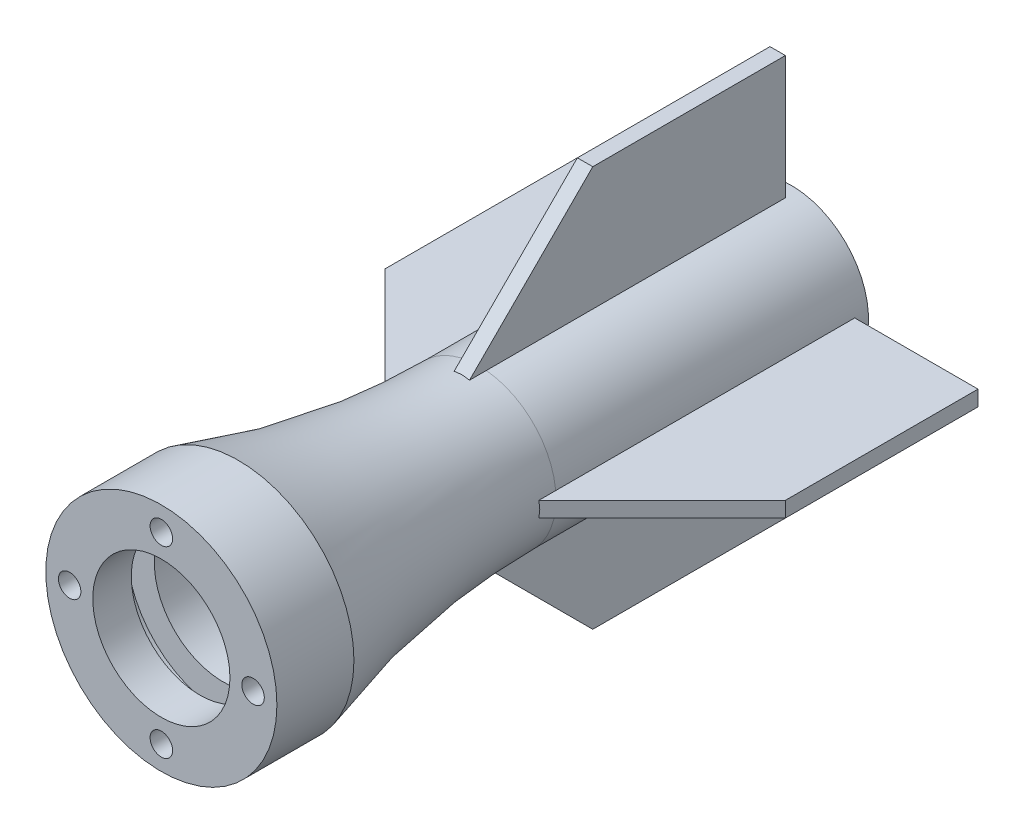
ISO-10303-21;
HEADER;
FILE_DESCRIPTION(('STEP AP214'),'2;1');
FILE_NAME('part.step','',(''),(''),'','','');
FILE_SCHEMA(('AUTOMOTIVE_DESIGN { 1 0 10303 214 1 1 1 1 }'));
ENDSEC;
DATA;
#1=APPLICATION_CONTEXT('core data for automotive mechanical design processes');
#2=APPLICATION_PROTOCOL_DEFINITION('international standard','automotive_design',2000,#1);
#3=PRODUCT_CONTEXT('',#1,'mechanical');
#4=PRODUCT('Part','Part','',(#3));
#5=PRODUCT_RELATED_PRODUCT_CATEGORY('part','',(#4));
#6=PRODUCT_DEFINITION_FORMATION('','',#4);
#7=PRODUCT_DEFINITION_CONTEXT('part definition',#1,'design');
#8=PRODUCT_DEFINITION('design','',#6,#7);
#9=PRODUCT_DEFINITION_SHAPE('','',#8);
#10=(LENGTH_UNIT() NAMED_UNIT(*) SI_UNIT(.MILLI.,.METRE.));
#11=(NAMED_UNIT(*) PLANE_ANGLE_UNIT() SI_UNIT($,.RADIAN.));
#12=(NAMED_UNIT(*) SI_UNIT($,.STERADIAN.) SOLID_ANGLE_UNIT());
#13=UNCERTAINTY_MEASURE_WITH_UNIT(LENGTH_MEASURE(1.E-05),#10,'distance_accuracy_value','');
#14=(GEOMETRIC_REPRESENTATION_CONTEXT(3) GLOBAL_UNCERTAINTY_ASSIGNED_CONTEXT((#13)) GLOBAL_UNIT_ASSIGNED_CONTEXT((#10,
#11,#12)) REPRESENTATION_CONTEXT('',''));
#15=CARTESIAN_POINT('',(0.,0.,0.));
#16=DIRECTION('',(0.,0.,1.));
#17=DIRECTION('',(1.,0.,0.));
#18=AXIS2_PLACEMENT_3D('',#15,#16,#17);
#19=CARTESIAN_POINT('',(-1.27000000000013,-12.7,0.));
#20=DIRECTION('',(0.,-1.,0.));
#21=DIRECTION('',(0.,0.,1.));
#22=AXIS2_PLACEMENT_3D('',#19,#20,#21);
#23=PLANE('',#22);
#24=DIRECTION('',(0.,0.,-1.));
#25=VECTOR('',#24,1.);
#26=CARTESIAN_POINT('',(1.26999999999987,-12.7,0.));
#27=LINE('',#26,#25);
#28=CARTESIAN_POINT('',(1.26999999999987,-12.7,52.0700000000002));
#29=VERTEX_POINT('',#28);
#30=CARTESIAN_POINT('',(1.26999999999987,-12.7,0.));
#31=VERTEX_POINT('',#30);
#32=EDGE_CURVE('E111',#29,#31,#27,.T.);
#33=ORIENTED_EDGE('',*,*,#32,.T.);
#34=DIRECTION('',(1.,0.,0.));
#35=VECTOR('',#34,1.);
#36=CARTESIAN_POINT('',(-1.27000000000013,-12.7,0.));
#37=LINE('',#36,#35);
#38=CARTESIAN_POINT('',(-1.27000000000013,-12.7,0.));
#39=VERTEX_POINT('',#38);
#40=EDGE_CURVE('E12',#39,#31,#37,.T.);
#41=ORIENTED_EDGE('',*,*,#40,.F.);
#42=DIRECTION('',(0.,0.,-1.));
#43=VECTOR('',#42,1.);
#44=CARTESIAN_POINT('',(-1.27000000000013,-12.7,0.));
#45=LINE('',#44,#43);
#46=CARTESIAN_POINT('',(-1.27000000000013,-12.7,52.0700000000002));
#47=VERTEX_POINT('',#46);
#48=EDGE_CURVE('E99',#47,#39,#45,.T.);
#49=ORIENTED_EDGE('',*,*,#48,.F.);
#50=DIRECTION('',(1.,0.,0.));
#51=VECTOR('',#50,1.);
#52=CARTESIAN_POINT('',(-1.27000000000013,-12.7,52.0700000000002));
#53=LINE('',#52,#51);
#54=EDGE_CURVE('E107',#47,#29,#53,.T.);
#55=ORIENTED_EDGE('',*,*,#54,.T.);
#56=EDGE_LOOP('',(#33,#41,#49,#55));
#57=FACE_BOUND('',#56,.T.);
#58=ADVANCED_FACE('F48',(#57),#23,.F.);
#59=CARTESIAN_POINT('',(-1.27000000000035,-33.02,0.));
#60=DIRECTION('',(0.,0.,1.));
#61=DIRECTION('',(0.,1.,0.));
#62=AXIS2_PLACEMENT_3D('',#59,#60,#61);
#63=PLANE('',#62);
#64=DIRECTION('',(0.,-1.,0.));
#65=VECTOR('',#64,1.);
#66=CARTESIAN_POINT('',(1.26999999999965,-33.02,0.));
#67=LINE('',#66,#65);
#68=CARTESIAN_POINT('',(1.26999999999965,-33.02,0.));
#69=VERTEX_POINT('',#68);
#70=EDGE_CURVE('E103',#31,#69,#67,.T.);
#71=ORIENTED_EDGE('',*,*,#70,.T.);
#72=DIRECTION('',(1.,0.,0.));
#73=VECTOR('',#72,1.);
#74=CARTESIAN_POINT('',(-1.27000000000035,-33.02,0.));
#75=LINE('',#74,#73);
#76=CARTESIAN_POINT('',(-1.27000000000035,-33.02,0.));
#77=VERTEX_POINT('',#76);
#78=EDGE_CURVE('E56',#77,#69,#75,.T.);
#79=ORIENTED_EDGE('',*,*,#78,.F.);
#80=DIRECTION('',(0.,-1.,0.));
#81=VECTOR('',#80,1.);
#82=CARTESIAN_POINT('',(-1.27000000000035,-33.02,0.));
#83=LINE('',#82,#81);
#84=EDGE_CURVE('E94',#39,#77,#83,.T.);
#85=ORIENTED_EDGE('',*,*,#84,.F.);
#86=ORIENTED_EDGE('',*,*,#40,.T.);
#87=EDGE_LOOP('',(#71,#79,#85,#86));
#88=FACE_BOUND('',#87,.T.);
#89=ADVANCED_FACE('F102',(#88),#63,.F.);
#90=CARTESIAN_POINT('',(-1.27000000000035,-33.02,31.75));
#91=DIRECTION('',(0.,1.,0.));
#92=DIRECTION('',(0.,0.,-1.));
#93=AXIS2_PLACEMENT_3D('',#90,#91,#92);
#94=PLANE('',#93);
#95=DIRECTION('',(0.,0.,1.));
#96=VECTOR('',#95,1.);
#97=CARTESIAN_POINT('',(1.26999999999965,-33.02,31.75));
#98=LINE('',#97,#96);
#99=CARTESIAN_POINT('',(1.26999999999965,-33.02,31.75));
#100=VERTEX_POINT('',#99);
#101=EDGE_CURVE('E81',#69,#100,#98,.T.);
#102=ORIENTED_EDGE('',*,*,#101,.T.);
#103=DIRECTION('',(1.,0.,0.));
#104=VECTOR('',#103,1.);
#105=CARTESIAN_POINT('',(-1.27000000000035,-33.02,31.75));
#106=LINE('',#105,#104);
#107=CARTESIAN_POINT('',(-1.27000000000035,-33.02,31.75));
#108=VERTEX_POINT('',#107);
#109=EDGE_CURVE('E104',#108,#100,#106,.T.);
#110=ORIENTED_EDGE('',*,*,#109,.F.);
#111=DIRECTION('',(0.,0.,1.));
#112=VECTOR('',#111,1.);
#113=CARTESIAN_POINT('',(-1.27000000000035,-33.02,31.75));
#114=LINE('',#113,#112);
#115=EDGE_CURVE('E97',#77,#108,#114,.T.);
#116=ORIENTED_EDGE('',*,*,#115,.F.);
#117=ORIENTED_EDGE('',*,*,#78,.T.);
#118=EDGE_LOOP('',(#102,#110,#116,#117));
#119=FACE_BOUND('',#118,.T.);
#120=ADVANCED_FACE('F105',(#119),#94,.F.);
#121=CARTESIAN_POINT('',(-1.27000000000013,-12.7,52.0700000000002));
#122=DIRECTION('',(0.,0.707106781186551,-0.707106781186544));
#123=DIRECTION('',(0.,-0.707106781186544,-0.707106781186551));
#124=AXIS2_PLACEMENT_3D('',#121,#122,#123);
#125=PLANE('',#124);
#126=DIRECTION('',(0.,0.707106781186544,0.707106781186551));
#127=VECTOR('',#126,1.);
#128=CARTESIAN_POINT('',(1.26999999999987,-12.7,52.0700000000002));
#129=LINE('',#128,#127);
#130=EDGE_CURVE('E87',#100,#29,#129,.T.);
#131=ORIENTED_EDGE('',*,*,#130,.T.);
#132=ORIENTED_EDGE('',*,*,#54,.F.);
#133=DIRECTION('',(0.,0.707106781186544,0.707106781186551));
#134=VECTOR('',#133,1.);
#135=CARTESIAN_POINT('',(-1.27000000000013,-12.7,52.0700000000002));
#136=LINE('',#135,#134);
#137=EDGE_CURVE('E64',#108,#47,#136,.T.);
#138=ORIENTED_EDGE('',*,*,#137,.F.);
#139=ORIENTED_EDGE('',*,*,#109,.T.);
#140=EDGE_LOOP('',(#131,#132,#138,#139));
#141=FACE_BOUND('',#140,.T.);
#142=ADVANCED_FACE('F118',(#141),#125,.F.);
#143=CARTESIAN_POINT('',(-1.27,0.,0.));
#144=DIRECTION('',(-1.,0.,0.));
#145=DIRECTION('',(0.,0.,1.));
#146=AXIS2_PLACEMENT_3D('',#143,#144,#145);
#147=PLANE('',#146);
#148=ORIENTED_EDGE('',*,*,#48,.T.);
#149=ORIENTED_EDGE('',*,*,#84,.T.);
#150=ORIENTED_EDGE('',*,*,#115,.T.);
#151=ORIENTED_EDGE('',*,*,#137,.T.);
#152=EDGE_LOOP('',(#148,#149,#150,#151));
#153=FACE_BOUND('',#152,.T.);
#154=ADVANCED_FACE('F95',(#153),#147,.T.);
#155=CARTESIAN_POINT('',(1.27,0.,0.));
#156=DIRECTION('',(-1.,0.,0.));
#157=DIRECTION('',(0.,0.,1.));
#158=AXIS2_PLACEMENT_3D('',#155,#156,#157);
#159=PLANE('',#158);
#160=ORIENTED_EDGE('',*,*,#32,.F.);
#161=ORIENTED_EDGE('',*,*,#130,.F.);
#162=ORIENTED_EDGE('',*,*,#101,.F.);
#163=ORIENTED_EDGE('',*,*,#70,.F.);
#164=EDGE_LOOP('',(#160,#161,#162,#163));
#165=FACE_BOUND('',#164,.T.);
#166=ADVANCED_FACE('F121',(#165),#159,.F.);
#167=CLOSED_SHELL('',(#58,#89,#120,#142,#154,#166));
#168=MANIFOLD_SOLID_BREP('B2',#167);
#169=CARTESIAN_POINT('',(12.7,-1.27,0.));
#170=DIRECTION('',(1.,0.,0.));
#171=DIRECTION('',(0.,0.,1.));
#172=AXIS2_PLACEMENT_3D('',#169,#170,#171);
#173=PLANE('',#172);
#174=DIRECTION('',(0.,0.,-1.));
#175=VECTOR('',#174,1.);
#176=CARTESIAN_POINT('',(12.7,1.27,0.));
#177=LINE('',#176,#175);
#178=CARTESIAN_POINT('',(12.7,1.27,52.0700000000002));
#179=VERTEX_POINT('',#178);
#180=CARTESIAN_POINT('',(12.7,1.27,0.));
#181=VERTEX_POINT('',#180);
#182=EDGE_CURVE('E245',#179,#181,#177,.T.);
#183=ORIENTED_EDGE('',*,*,#182,.T.);
#184=DIRECTION('',(0.,1.,0.));
#185=VECTOR('',#184,1.);
#186=CARTESIAN_POINT('',(12.7,-1.27,0.));
#187=LINE('',#186,#185);
#188=CARTESIAN_POINT('',(12.7,-1.27,0.));
#189=VERTEX_POINT('',#188);
#190=EDGE_CURVE('E46',#189,#181,#187,.T.);
#191=ORIENTED_EDGE('',*,*,#190,.F.);
#192=DIRECTION('',(0.,0.,-1.));
#193=VECTOR('',#192,1.);
#194=CARTESIAN_POINT('',(12.7,-1.27,0.));
#195=LINE('',#194,#193);
#196=CARTESIAN_POINT('',(12.7,-1.27,52.0700000000002));
#197=VERTEX_POINT('',#196);
#198=EDGE_CURVE('E233',#197,#189,#195,.T.);
#199=ORIENTED_EDGE('',*,*,#198,.F.);
#200=DIRECTION('',(0.,1.,0.));
#201=VECTOR('',#200,1.);
#202=CARTESIAN_POINT('',(12.7,-1.27,52.0700000000002));
#203=LINE('',#202,#201);
#204=EDGE_CURVE('E241',#197,#179,#203,.T.);
#205=ORIENTED_EDGE('',*,*,#204,.T.);
#206=EDGE_LOOP('',(#183,#191,#199,#205));
#207=FACE_BOUND('',#206,.T.);
#208=ADVANCED_FACE('F182',(#207),#173,.F.);
#209=CARTESIAN_POINT('',(33.02,-1.27,0.));
#210=DIRECTION('',(0.,0.,1.));
#211=DIRECTION('',(-1.,0.,0.));
#212=AXIS2_PLACEMENT_3D('',#209,#210,#211);
#213=PLANE('',#212);
#214=DIRECTION('',(1.,0.,0.));
#215=VECTOR('',#214,1.);
#216=CARTESIAN_POINT('',(33.02,1.27,0.));
#217=LINE('',#216,#215);
#218=CARTESIAN_POINT('',(33.02,1.27,0.));
#219=VERTEX_POINT('',#218);
#220=EDGE_CURVE('E237',#181,#219,#217,.T.);
#221=ORIENTED_EDGE('',*,*,#220,.T.);
#222=DIRECTION('',(0.,1.,0.));
#223=VECTOR('',#222,1.);
#224=CARTESIAN_POINT('',(33.02,-1.27,0.));
#225=LINE('',#224,#223);
#226=CARTESIAN_POINT('',(33.02,-1.27,0.));
#227=VERTEX_POINT('',#226);
#228=EDGE_CURVE('E190',#227,#219,#225,.T.);
#229=ORIENTED_EDGE('',*,*,#228,.F.);
#230=DIRECTION('',(1.,0.,0.));
#231=VECTOR('',#230,1.);
#232=CARTESIAN_POINT('',(33.02,-1.27,0.));
#233=LINE('',#232,#231);
#234=EDGE_CURVE('E228',#189,#227,#233,.T.);
#235=ORIENTED_EDGE('',*,*,#234,.F.);
#236=ORIENTED_EDGE('',*,*,#190,.T.);
#237=EDGE_LOOP('',(#221,#229,#235,#236));
#238=FACE_BOUND('',#237,.T.);
#239=ADVANCED_FACE('F236',(#238),#213,.F.);
#240=CARTESIAN_POINT('',(33.02,-1.27,31.75));
#241=DIRECTION('',(-1.,0.,0.));
#242=DIRECTION('',(0.,0.,-1.));
#243=AXIS2_PLACEMENT_3D('',#240,#241,#242);
#244=PLANE('',#243);
#245=DIRECTION('',(0.,0.,1.));
#246=VECTOR('',#245,1.);
#247=CARTESIAN_POINT('',(33.02,1.27,31.75));
#248=LINE('',#247,#246);
#249=CARTESIAN_POINT('',(33.02,1.27,31.75));
#250=VERTEX_POINT('',#249);
#251=EDGE_CURVE('E215',#219,#250,#248,.T.);
#252=ORIENTED_EDGE('',*,*,#251,.T.);
#253=DIRECTION('',(0.,1.,0.));
#254=VECTOR('',#253,1.);
#255=CARTESIAN_POINT('',(33.02,-1.27,31.75));
#256=LINE('',#255,#254);
#257=CARTESIAN_POINT('',(33.02,-1.27,31.75));
#258=VERTEX_POINT('',#257);
#259=EDGE_CURVE('E238',#258,#250,#256,.T.);
#260=ORIENTED_EDGE('',*,*,#259,.F.);
#261=DIRECTION('',(0.,0.,1.));
#262=VECTOR('',#261,1.);
#263=CARTESIAN_POINT('',(33.02,-1.27,31.75));
#264=LINE('',#263,#262);
#265=EDGE_CURVE('E231',#227,#258,#264,.T.);
#266=ORIENTED_EDGE('',*,*,#265,.F.);
#267=ORIENTED_EDGE('',*,*,#228,.T.);
#268=EDGE_LOOP('',(#252,#260,#266,#267));
#269=FACE_BOUND('',#268,.T.);
#270=ADVANCED_FACE('F239',(#269),#244,.F.);
#271=CARTESIAN_POINT('',(12.7,-1.27,52.0700000000002));
#272=DIRECTION('',(-0.707106781186551,0.,-0.707106781186544));
#273=DIRECTION('',(0.707106781186544,0.,-0.707106781186551));
#274=AXIS2_PLACEMENT_3D('',#271,#272,#273);
#275=PLANE('',#274);
#276=DIRECTION('',(-0.707106781186544,0.,0.707106781186551));
#277=VECTOR('',#276,1.);
#278=CARTESIAN_POINT('',(12.7,1.27,52.0700000000002));
#279=LINE('',#278,#277);
#280=EDGE_CURVE('E221',#250,#179,#279,.T.);
#281=ORIENTED_EDGE('',*,*,#280,.T.);
#282=ORIENTED_EDGE('',*,*,#204,.F.);
#283=DIRECTION('',(-0.707106781186544,0.,0.707106781186551));
#284=VECTOR('',#283,1.);
#285=CARTESIAN_POINT('',(12.7,-1.27,52.0700000000002));
#286=LINE('',#285,#284);
#287=EDGE_CURVE('E198',#258,#197,#286,.T.);
#288=ORIENTED_EDGE('',*,*,#287,.F.);
#289=ORIENTED_EDGE('',*,*,#259,.T.);
#290=EDGE_LOOP('',(#281,#282,#288,#289));
#291=FACE_BOUND('',#290,.T.);
#292=ADVANCED_FACE('F252',(#291),#275,.F.);
#293=CARTESIAN_POINT('',(0.,-1.27,0.));
#294=DIRECTION('',(0.,-1.,0.));
#295=DIRECTION('',(0.,0.,1.));
#296=AXIS2_PLACEMENT_3D('',#293,#294,#295);
#297=PLANE('',#296);
#298=ORIENTED_EDGE('',*,*,#198,.T.);
#299=ORIENTED_EDGE('',*,*,#234,.T.);
#300=ORIENTED_EDGE('',*,*,#265,.T.);
#301=ORIENTED_EDGE('',*,*,#287,.T.);
#302=EDGE_LOOP('',(#298,#299,#300,#301));
#303=FACE_BOUND('',#302,.T.);
#304=ADVANCED_FACE('F229',(#303),#297,.T.);
#305=CARTESIAN_POINT('',(0.,1.27,0.));
#306=DIRECTION('',(0.,-1.,0.));
#307=DIRECTION('',(0.,0.,1.));
#308=AXIS2_PLACEMENT_3D('',#305,#306,#307);
#309=PLANE('',#308);
#310=ORIENTED_EDGE('',*,*,#182,.F.);
#311=ORIENTED_EDGE('',*,*,#280,.F.);
#312=ORIENTED_EDGE('',*,*,#251,.F.);
#313=ORIENTED_EDGE('',*,*,#220,.F.);
#314=EDGE_LOOP('',(#310,#311,#312,#313));
#315=FACE_BOUND('',#314,.T.);
#316=ADVANCED_FACE('F255',(#315),#309,.F.);
#317=CLOSED_SHELL('',(#208,#239,#270,#292,#304,#316));
#318=MANIFOLD_SOLID_BREP('B6',#317);
#319=CARTESIAN_POINT('',(1.27000000000004,12.7,0.));
#320=DIRECTION('',(0.,1.,0.));
#321=DIRECTION('',(0.,0.,1.));
#322=AXIS2_PLACEMENT_3D('',#319,#320,#321);
#323=PLANE('',#322);
#324=DIRECTION('',(0.,0.,-1.));
#325=VECTOR('',#324,1.);
#326=CARTESIAN_POINT('',(-1.26999999999996,12.7,0.));
#327=LINE('',#326,#325);
#328=CARTESIAN_POINT('',(-1.26999999999996,12.7,52.0700000000002));
#329=VERTEX_POINT('',#328);
#330=CARTESIAN_POINT('',(-1.26999999999996,12.7,0.));
#331=VERTEX_POINT('',#330);
#332=EDGE_CURVE('E379',#329,#331,#327,.T.);
#333=ORIENTED_EDGE('',*,*,#332,.T.);
#334=DIRECTION('',(-1.,0.,0.));
#335=VECTOR('',#334,1.);
#336=CARTESIAN_POINT('',(1.27000000000004,12.7,0.));
#337=LINE('',#336,#335);
#338=CARTESIAN_POINT('',(1.27000000000004,12.7,0.));
#339=VERTEX_POINT('',#338);
#340=EDGE_CURVE('E180',#339,#331,#337,.T.);
#341=ORIENTED_EDGE('',*,*,#340,.F.);
#342=DIRECTION('',(0.,0.,-1.));
#343=VECTOR('',#342,1.);
#344=CARTESIAN_POINT('',(1.27000000000004,12.7,0.));
#345=LINE('',#344,#343);
#346=CARTESIAN_POINT('',(1.27000000000004,12.7,52.0700000000002));
#347=VERTEX_POINT('',#346);
#348=EDGE_CURVE('E367',#347,#339,#345,.T.);
#349=ORIENTED_EDGE('',*,*,#348,.F.);
#350=DIRECTION('',(-1.,0.,0.));
#351=VECTOR('',#350,1.);
#352=CARTESIAN_POINT('',(1.27000000000004,12.7,52.0700000000002));
#353=LINE('',#352,#351);
#354=EDGE_CURVE('E375',#347,#329,#353,.T.);
#355=ORIENTED_EDGE('',*,*,#354,.T.);
#356=EDGE_LOOP('',(#333,#341,#349,#355));
#357=FACE_BOUND('',#356,.T.);
#358=ADVANCED_FACE('F316',(#357),#323,.F.);
#359=CARTESIAN_POINT('',(1.27000000000012,33.02,0.));
#360=DIRECTION('',(0.,0.,1.));
#361=DIRECTION('',(0.,-1.,0.));
#362=AXIS2_PLACEMENT_3D('',#359,#360,#361);
#363=PLANE('',#362);
#364=DIRECTION('',(0.,1.,0.));
#365=VECTOR('',#364,1.);
#366=CARTESIAN_POINT('',(-1.26999999999988,33.02,0.));
#367=LINE('',#366,#365);
#368=CARTESIAN_POINT('',(-1.26999999999988,33.02,0.));
#369=VERTEX_POINT('',#368);
#370=EDGE_CURVE('E371',#331,#369,#367,.T.);
#371=ORIENTED_EDGE('',*,*,#370,.T.);
#372=DIRECTION('',(-1.,0.,0.));
#373=VECTOR('',#372,1.);
#374=CARTESIAN_POINT('',(1.27000000000012,33.02,0.));
#375=LINE('',#374,#373);
#376=CARTESIAN_POINT('',(1.27000000000012,33.02,0.));
#377=VERTEX_POINT('',#376);
#378=EDGE_CURVE('E324',#377,#369,#375,.T.);
#379=ORIENTED_EDGE('',*,*,#378,.F.);
#380=DIRECTION('',(0.,1.,0.));
#381=VECTOR('',#380,1.);
#382=CARTESIAN_POINT('',(1.27000000000012,33.02,0.));
#383=LINE('',#382,#381);
#384=EDGE_CURVE('E362',#339,#377,#383,.T.);
#385=ORIENTED_EDGE('',*,*,#384,.F.);
#386=ORIENTED_EDGE('',*,*,#340,.T.);
#387=EDGE_LOOP('',(#371,#379,#385,#386));
#388=FACE_BOUND('',#387,.T.);
#389=ADVANCED_FACE('F370',(#388),#363,.F.);
#390=CARTESIAN_POINT('',(1.27000000000012,33.02,31.75));
#391=DIRECTION('',(0.,-1.,0.));
#392=DIRECTION('',(0.,0.,-1.));
#393=AXIS2_PLACEMENT_3D('',#390,#391,#392);
#394=PLANE('',#393);
#395=DIRECTION('',(0.,0.,1.));
#396=VECTOR('',#395,1.);
#397=CARTESIAN_POINT('',(-1.26999999999988,33.02,31.75));
#398=LINE('',#397,#396);
#399=CARTESIAN_POINT('',(-1.26999999999988,33.02,31.75));
#400=VERTEX_POINT('',#399);
#401=EDGE_CURVE('E349',#369,#400,#398,.T.);
#402=ORIENTED_EDGE('',*,*,#401,.T.);
#403=DIRECTION('',(-1.,0.,0.));
#404=VECTOR('',#403,1.);
#405=CARTESIAN_POINT('',(1.27000000000012,33.02,31.75));
#406=LINE('',#405,#404);
#407=CARTESIAN_POINT('',(1.27000000000012,33.02,31.75));
#408=VERTEX_POINT('',#407);
#409=EDGE_CURVE('E372',#408,#400,#406,.T.);
#410=ORIENTED_EDGE('',*,*,#409,.F.);
#411=DIRECTION('',(0.,0.,1.));
#412=VECTOR('',#411,1.);
#413=CARTESIAN_POINT('',(1.27000000000012,33.02,31.75));
#414=LINE('',#413,#412);
#415=EDGE_CURVE('E365',#377,#408,#414,.T.);
#416=ORIENTED_EDGE('',*,*,#415,.F.);
#417=ORIENTED_EDGE('',*,*,#378,.T.);
#418=EDGE_LOOP('',(#402,#410,#416,#417));
#419=FACE_BOUND('',#418,.T.);
#420=ADVANCED_FACE('F373',(#419),#394,.F.);
#421=CARTESIAN_POINT('',(1.27000000000004,12.7,52.0700000000002));
#422=DIRECTION('',(0.,-0.707106781186551,-0.707106781186544));
#423=DIRECTION('',(0.,0.707106781186544,-0.707106781186551));
#424=AXIS2_PLACEMENT_3D('',#421,#422,#423);
#425=PLANE('',#424);
#426=DIRECTION('',(0.,-0.707106781186544,0.707106781186551));
#427=VECTOR('',#426,1.);
#428=CARTESIAN_POINT('',(-1.26999999999996,12.7,52.0700000000002));
#429=LINE('',#428,#427);
#430=EDGE_CURVE('E355',#400,#329,#429,.T.);
#431=ORIENTED_EDGE('',*,*,#430,.T.);
#432=ORIENTED_EDGE('',*,*,#354,.F.);
#433=DIRECTION('',(0.,-0.707106781186544,0.707106781186551));
#434=VECTOR('',#433,1.);
#435=CARTESIAN_POINT('',(1.27000000000004,12.7,52.0700000000002));
#436=LINE('',#435,#434);
#437=EDGE_CURVE('E332',#408,#347,#436,.T.);
#438=ORIENTED_EDGE('',*,*,#437,.F.);
#439=ORIENTED_EDGE('',*,*,#409,.T.);
#440=EDGE_LOOP('',(#431,#432,#438,#439));
#441=FACE_BOUND('',#440,.T.);
#442=ADVANCED_FACE('F386',(#441),#425,.F.);
#443=CARTESIAN_POINT('',(1.27,0.,0.));
#444=DIRECTION('',(1.,0.,0.));
#445=DIRECTION('',(0.,0.,1.));
#446=AXIS2_PLACEMENT_3D('',#443,#444,#445);
#447=PLANE('',#446);
#448=ORIENTED_EDGE('',*,*,#348,.T.);
#449=ORIENTED_EDGE('',*,*,#384,.T.);
#450=ORIENTED_EDGE('',*,*,#415,.T.);
#451=ORIENTED_EDGE('',*,*,#437,.T.);
#452=EDGE_LOOP('',(#448,#449,#450,#451));
#453=FACE_BOUND('',#452,.T.);
#454=ADVANCED_FACE('F363',(#453),#447,.T.);
#455=CARTESIAN_POINT('',(-1.27,0.,0.));
#456=DIRECTION('',(1.,0.,0.));
#457=DIRECTION('',(0.,0.,1.));
#458=AXIS2_PLACEMENT_3D('',#455,#456,#457);
#459=PLANE('',#458);
#460=ORIENTED_EDGE('',*,*,#332,.F.);
#461=ORIENTED_EDGE('',*,*,#430,.F.);
#462=ORIENTED_EDGE('',*,*,#401,.F.);
#463=ORIENTED_EDGE('',*,*,#370,.F.);
#464=EDGE_LOOP('',(#460,#461,#462,#463));
#465=FACE_BOUND('',#464,.T.);
#466=ADVANCED_FACE('F389',(#465),#459,.F.);
#467=CLOSED_SHELL('',(#358,#389,#420,#442,#454,#466));
#468=MANIFOLD_SOLID_BREP('B40',#467);
#469=CARTESIAN_POINT('',(-12.7,1.27,0.));
#470=DIRECTION('',(-1.,0.,0.));
#471=DIRECTION('',(0.,0.,1.));
#472=AXIS2_PLACEMENT_3D('',#469,#470,#471);
#473=PLANE('',#472);
#474=DIRECTION('',(0.,0.,-1.));
#475=VECTOR('',#474,1.);
#476=CARTESIAN_POINT('',(-12.7,-1.27,0.));
#477=LINE('',#476,#475);
#478=CARTESIAN_POINT('',(-12.7,-1.27,52.0700000000002));
#479=VERTEX_POINT('',#478);
#480=CARTESIAN_POINT('',(-12.7,-1.27,0.));
#481=VERTEX_POINT('',#480);
#482=EDGE_CURVE('E510',#479,#481,#477,.T.);
#483=ORIENTED_EDGE('',*,*,#482,.T.);
#484=DIRECTION('',(0.,-1.,0.));
#485=VECTOR('',#484,1.);
#486=CARTESIAN_POINT('',(-12.7,1.27,0.));
#487=LINE('',#486,#485);
#488=CARTESIAN_POINT('',(-12.7,1.27,0.));
#489=VERTEX_POINT('',#488);
#490=EDGE_CURVE('E314',#489,#481,#487,.T.);
#491=ORIENTED_EDGE('',*,*,#490,.F.);
#492=DIRECTION('',(0.,0.,-1.));
#493=VECTOR('',#492,1.);
#494=CARTESIAN_POINT('',(-12.7,1.27,0.));
#495=LINE('',#494,#493);
#496=CARTESIAN_POINT('',(-12.7,1.27,52.0700000000002));
#497=VERTEX_POINT('',#496);
#498=EDGE_CURVE('E498',#497,#489,#495,.T.);
#499=ORIENTED_EDGE('',*,*,#498,.F.);
#500=DIRECTION('',(0.,-1.,0.));
#501=VECTOR('',#500,1.);
#502=CARTESIAN_POINT('',(-12.7,1.27,52.0700000000002));
#503=LINE('',#502,#501);
#504=EDGE_CURVE('E506',#497,#479,#503,.T.);
#505=ORIENTED_EDGE('',*,*,#504,.T.);
#506=EDGE_LOOP('',(#483,#491,#499,#505));
#507=FACE_BOUND('',#506,.T.);
#508=ADVANCED_FACE('F447',(#507),#473,.F.);
#509=CARTESIAN_POINT('',(-33.02,1.27,0.));
#510=DIRECTION('',(0.,0.,1.));
#511=DIRECTION('',(1.,0.,0.));
#512=AXIS2_PLACEMENT_3D('',#509,#510,#511);
#513=PLANE('',#512);
#514=DIRECTION('',(-1.,0.,0.));
#515=VECTOR('',#514,1.);
#516=CARTESIAN_POINT('',(-33.02,-1.27,0.));
#517=LINE('',#516,#515);
#518=CARTESIAN_POINT('',(-33.02,-1.27,0.));
#519=VERTEX_POINT('',#518);
#520=EDGE_CURVE('E502',#481,#519,#517,.T.);
#521=ORIENTED_EDGE('',*,*,#520,.T.);
#522=DIRECTION('',(0.,-1.,0.));
#523=VECTOR('',#522,1.);
#524=CARTESIAN_POINT('',(-33.02,1.27,0.));
#525=LINE('',#524,#523);
#526=CARTESIAN_POINT('',(-33.02,1.27,0.));
#527=VERTEX_POINT('',#526);
#528=EDGE_CURVE('E455',#527,#519,#525,.T.);
#529=ORIENTED_EDGE('',*,*,#528,.F.);
#530=DIRECTION('',(-1.,0.,0.));
#531=VECTOR('',#530,1.);
#532=CARTESIAN_POINT('',(-33.02,1.27,0.));
#533=LINE('',#532,#531);
#534=EDGE_CURVE('E493',#489,#527,#533,.T.);
#535=ORIENTED_EDGE('',*,*,#534,.F.);
#536=ORIENTED_EDGE('',*,*,#490,.T.);
#537=EDGE_LOOP('',(#521,#529,#535,#536));
#538=FACE_BOUND('',#537,.T.);
#539=ADVANCED_FACE('F501',(#538),#513,.F.);
#540=CARTESIAN_POINT('',(-33.02,1.27,31.75));
#541=DIRECTION('',(1.,0.,0.));
#542=DIRECTION('',(0.,0.,-1.));
#543=AXIS2_PLACEMENT_3D('',#540,#541,#542);
#544=PLANE('',#543);
#545=DIRECTION('',(0.,0.,1.));
#546=VECTOR('',#545,1.);
#547=CARTESIAN_POINT('',(-33.02,-1.27,31.75));
#548=LINE('',#547,#546);
#549=CARTESIAN_POINT('',(-33.02,-1.27,31.75));
#550=VERTEX_POINT('',#549);
#551=EDGE_CURVE('E480',#519,#550,#548,.T.);
#552=ORIENTED_EDGE('',*,*,#551,.T.);
#553=DIRECTION('',(0.,-1.,0.));
#554=VECTOR('',#553,1.);
#555=CARTESIAN_POINT('',(-33.02,1.27,31.75));
#556=LINE('',#555,#554);
#557=CARTESIAN_POINT('',(-33.02,1.27,31.75));
#558=VERTEX_POINT('',#557);
#559=EDGE_CURVE('E503',#558,#550,#556,.T.);
#560=ORIENTED_EDGE('',*,*,#559,.F.);
#561=DIRECTION('',(0.,0.,1.));
#562=VECTOR('',#561,1.);
#563=CARTESIAN_POINT('',(-33.02,1.27,31.75));
#564=LINE('',#563,#562);
#565=EDGE_CURVE('E496',#527,#558,#564,.T.);
#566=ORIENTED_EDGE('',*,*,#565,.F.);
#567=ORIENTED_EDGE('',*,*,#528,.T.);
#568=EDGE_LOOP('',(#552,#560,#566,#567));
#569=FACE_BOUND('',#568,.T.);
#570=ADVANCED_FACE('F504',(#569),#544,.F.);
#571=CARTESIAN_POINT('',(-12.7,1.27,52.0700000000002));
#572=DIRECTION('',(0.707106781186551,0.,-0.707106781186544));
#573=DIRECTION('',(-0.707106781186544,0.,-0.707106781186551));
#574=AXIS2_PLACEMENT_3D('',#571,#572,#573);
#575=PLANE('',#574);
#576=DIRECTION('',(0.707106781186544,0.,0.707106781186551));
#577=VECTOR('',#576,1.);
#578=CARTESIAN_POINT('',(-12.7,-1.27,52.0700000000002));
#579=LINE('',#578,#577);
#580=EDGE_CURVE('E486',#550,#479,#579,.T.);
#581=ORIENTED_EDGE('',*,*,#580,.T.);
#582=ORIENTED_EDGE('',*,*,#504,.F.);
#583=DIRECTION('',(0.707106781186544,0.,0.707106781186551));
#584=VECTOR('',#583,1.);
#585=CARTESIAN_POINT('',(-12.7,1.27,52.0700000000002));
#586=LINE('',#585,#584);
#587=EDGE_CURVE('E463',#558,#497,#586,.T.);
#588=ORIENTED_EDGE('',*,*,#587,.F.);
#589=ORIENTED_EDGE('',*,*,#559,.T.);
#590=EDGE_LOOP('',(#581,#582,#588,#589));
#591=FACE_BOUND('',#590,.T.);
#592=ADVANCED_FACE('F517',(#591),#575,.F.);
#593=CARTESIAN_POINT('',(0.,1.27,0.));
#594=DIRECTION('',(0.,1.,0.));
#595=DIRECTION('',(0.,0.,1.));
#596=AXIS2_PLACEMENT_3D('',#593,#594,#595);
#597=PLANE('',#596);
#598=ORIENTED_EDGE('',*,*,#498,.T.);
#599=ORIENTED_EDGE('',*,*,#534,.T.);
#600=ORIENTED_EDGE('',*,*,#565,.T.);
#601=ORIENTED_EDGE('',*,*,#587,.T.);
#602=EDGE_LOOP('',(#598,#599,#600,#601));
#603=FACE_BOUND('',#602,.T.);
#604=ADVANCED_FACE('F494',(#603),#597,.T.);
#605=CARTESIAN_POINT('',(0.,-1.27,0.));
#606=DIRECTION('',(0.,1.,0.));
#607=DIRECTION('',(0.,0.,1.));
#608=AXIS2_PLACEMENT_3D('',#605,#606,#607);
#609=PLANE('',#608);
#610=ORIENTED_EDGE('',*,*,#482,.F.);
#611=ORIENTED_EDGE('',*,*,#580,.F.);
#612=ORIENTED_EDGE('',*,*,#551,.F.);
#613=ORIENTED_EDGE('',*,*,#520,.F.);
#614=EDGE_LOOP('',(#610,#611,#612,#613));
#615=FACE_BOUND('',#614,.T.);
#616=ADVANCED_FACE('F520',(#615),#609,.F.);
#617=CLOSED_SHELL('',(#508,#539,#570,#592,#604,#616));
#618=MANIFOLD_SOLID_BREP('B174',#617);
#619=CARTESIAN_POINT('',(0.,0.,101.6));
#620=DIRECTION('',(0.,0.,-1.));
#621=DIRECTION('',(-1.,0.,0.));
#622=AXIS2_PLACEMENT_3D('',#619,#620,#621);
#623=CYLINDRICAL_SURFACE('',#622,11.30808);
#624=CARTESIAN_POINT('',(0.,0.,0.));
#625=DIRECTION('',(0.,0.,1.));
#626=DIRECTION('',(1.,0.,0.));
#627=AXIS2_PLACEMENT_3D('',#624,#625,#626);
#628=CIRCLE('',#627,11.30808);
#629=CARTESIAN_POINT('',(11.30808,0.,0.));
#630=VERTEX_POINT('',#629);
#631=EDGE_CURVE('E584',#630,#630,#628,.T.);
#632=ORIENTED_EDGE('',*,*,#631,.F.);
#633=EDGE_LOOP('',(#632));
#634=FACE_BOUND('',#633,.T.);
#635=CARTESIAN_POINT('',(0.,0.,91.44));
#636=DIRECTION('',(0.,0.,1.));
#637=DIRECTION('',(1.,0.,0.));
#638=AXIS2_PLACEMENT_3D('',#635,#636,#637);
#639=CIRCLE('',#638,11.30808);
#640=CARTESIAN_POINT('',(11.30808,0.,91.44));
#641=VERTEX_POINT('',#640);
#642=EDGE_CURVE('E575',#641,#641,#639,.T.);
#643=ORIENTED_EDGE('',*,*,#642,.T.);
#644=EDGE_LOOP('',(#643));
#645=FACE_BOUND('',#644,.T.);
#646=ADVANCED_FACE('F571',(#634,#645),#623,.F.);
#647=CARTESIAN_POINT('',(0.,0.,101.6));
#648=DIRECTION('',(0.,0.,-1.));
#649=DIRECTION('',(-1.,0.,0.));
#650=AXIS2_PLACEMENT_3D('',#647,#648,#649);
#651=CYLINDRICAL_SURFACE('',#650,12.7);
#652=CARTESIAN_POINT('',(0.,0.,49.2442627101701));
#653=DIRECTION('',(0.,0.,1.));
#654=DIRECTION('',(1.,0.,0.));
#655=AXIS2_PLACEMENT_3D('',#652,#653,#654);
#656=CIRCLE('',#655,12.7);
#657=CARTESIAN_POINT('',(12.7,0.,49.2442627101701));
#658=VERTEX_POINT('',#657);
#659=EDGE_CURVE('E446',#658,#658,#656,.F.);
#660=ORIENTED_EDGE('',*,*,#659,.T.);
#661=EDGE_LOOP('',(#660));
#662=FACE_BOUND('',#661,.T.);
#663=CARTESIAN_POINT('',(0.,0.,-2.27));
#664=DIRECTION('',(0.,0.,-1.));
#665=DIRECTION('',(-1.,0.,0.));
#666=AXIS2_PLACEMENT_3D('',#663,#664,#665);
#667=CIRCLE('',#666,12.7);
#668=CARTESIAN_POINT('',(-12.7,0.,-2.27));
#669=VERTEX_POINT('',#668);
#670=EDGE_CURVE('E635',#669,#669,#667,.T.);
#671=ORIENTED_EDGE('',*,*,#670,.F.);
#672=EDGE_LOOP('',(#671));
#673=FACE_BOUND('',#672,.T.);
#674=ADVANCED_FACE('F666',(#662,#673),#651,.T.);
#675=CARTESIAN_POINT('',(0.,0.,-1.));
#676=DIRECTION('',(0.,0.,-1.));
#677=DIRECTION('',(-1.,0.,0.));
#678=AXIS2_PLACEMENT_3D('',#675,#676,#677);
#679=PLANE('',#678);
#680=CARTESIAN_POINT('',(0.,0.,-1.));
#681=DIRECTION('',(0.,0.,-1.));
#682=DIRECTION('',(-1.,0.,0.));
#683=AXIS2_PLACEMENT_3D('',#680,#681,#682);
#684=CIRCLE('',#683,1.);
#685=CARTESIAN_POINT('',(-1.,0.,-1.));
#686=VERTEX_POINT('',#685);
#687=EDGE_CURVE('E641',#686,#686,#684,.T.);
#688=ORIENTED_EDGE('',*,*,#687,.F.);
#689=EDGE_LOOP('',(#688));
#690=FACE_BOUND('',#689,.T.);
#691=CARTESIAN_POINT('',(0.,0.,-1.));
#692=DIRECTION('',(0.,0.,-1.));
#693=DIRECTION('',(-1.,0.,0.));
#694=AXIS2_PLACEMENT_3D('',#691,#692,#693);
#695=CIRCLE('',#694,2.);
#696=CARTESIAN_POINT('',(-2.,0.,-1.));
#697=VERTEX_POINT('',#696);
#698=EDGE_CURVE('E629',#697,#697,#695,.T.);
#699=ORIENTED_EDGE('',*,*,#698,.T.);
#700=EDGE_LOOP('',(#699));
#701=FACE_BOUND('',#700,.T.);
#702=ADVANCED_FACE('F672',(#690,#701),#679,.T.);
#703=CARTESIAN_POINT('',(0.,0.,101.6));
#704=DIRECTION('',(0.,0.,1.));
#705=DIRECTION('',(1.,0.,0.));
#706=AXIS2_PLACEMENT_3D('',#703,#704,#705);
#707=PLANE('',#706);
#708=CARTESIAN_POINT('',(-15.11808,0.,101.6));
#709=DIRECTION('',(0.,0.,1.));
#710=DIRECTION('',(1.,0.,0.));
#711=AXIS2_PLACEMENT_3D('',#708,#709,#710);
#712=CIRCLE('',#711,1.8542);
#713=CARTESIAN_POINT('',(-13.26388,0.,101.6));
#714=VERTEX_POINT('',#713);
#715=EDGE_CURVE('E606',#714,#714,#712,.T.);
#716=ORIENTED_EDGE('',*,*,#715,.F.);
#717=EDGE_LOOP('',(#716));
#718=FACE_BOUND('',#717,.T.);
#719=CARTESIAN_POINT('',(0.,15.11808,101.6));
#720=DIRECTION('',(0.,0.,1.));
#721=DIRECTION('',(1.,0.,0.));
#722=AXIS2_PLACEMENT_3D('',#719,#720,#721);
#723=CIRCLE('',#722,1.8542);
#724=CARTESIAN_POINT('',(1.8542,15.11808,101.6));
#725=VERTEX_POINT('',#724);
#726=EDGE_CURVE('E612',#725,#725,#723,.T.);
#727=ORIENTED_EDGE('',*,*,#726,.F.);
#728=EDGE_LOOP('',(#727));
#729=FACE_BOUND('',#728,.T.);
#730=CARTESIAN_POINT('',(15.11808,0.,101.6));
#731=DIRECTION('',(0.,0.,1.));
#732=DIRECTION('',(1.,0.,0.));
#733=AXIS2_PLACEMENT_3D('',#730,#731,#732);
#734=CIRCLE('',#733,1.8542);
#735=CARTESIAN_POINT('',(16.97228,0.,101.6));
#736=VERTEX_POINT('',#735);
#737=EDGE_CURVE('E618',#736,#736,#734,.T.);
#738=ORIENTED_EDGE('',*,*,#737,.F.);
#739=EDGE_LOOP('',(#738));
#740=FACE_BOUND('',#739,.T.);
#741=CARTESIAN_POINT('',(0.,-15.11808,101.6));
#742=DIRECTION('',(0.,0.,1.));
#743=DIRECTION('',(1.,0.,0.));
#744=AXIS2_PLACEMENT_3D('',#741,#742,#743);
#745=CIRCLE('',#744,1.8542);
#746=CARTESIAN_POINT('',(1.8542,-15.11808,101.6));
#747=VERTEX_POINT('',#746);
#748=EDGE_CURVE('E593',#747,#747,#745,.T.);
#749=ORIENTED_EDGE('',*,*,#748,.F.);
#750=EDGE_LOOP('',(#749));
#751=FACE_BOUND('',#750,.T.);
#752=CARTESIAN_POINT('',(0.,0.,101.6));
#753=DIRECTION('',(0.,0.,1.));
#754=DIRECTION('',(1.,0.,0.));
#755=AXIS2_PLACEMENT_3D('',#752,#753,#754);
#756=CIRCLE('',#755,11.30808);
#757=CARTESIAN_POINT('',(11.30808,0.,101.6));
#758=VERTEX_POINT('',#757);
#759=EDGE_CURVE('E579',#758,#758,#756,.T.);
#760=ORIENTED_EDGE('',*,*,#759,.F.);
#761=EDGE_LOOP('',(#760));
#762=FACE_BOUND('',#761,.T.);
#763=CARTESIAN_POINT('',(0.,0.,101.6));
#764=DIRECTION('',(0.,0.,1.));
#765=DIRECTION('',(1.,0.,0.));
#766=AXIS2_PLACEMENT_3D('',#763,#764,#765);
#767=CIRCLE('',#766,19.05);
#768=CARTESIAN_POINT('',(19.05,0.,101.6));
#769=VERTEX_POINT('',#768);
#770=EDGE_CURVE('E605',#769,#769,#767,.T.);
#771=ORIENTED_EDGE('',*,*,#770,.T.);
#772=EDGE_LOOP('',(#771));
#773=FACE_BOUND('',#772,.T.);
#774=ADVANCED_FACE('F677',(#718,#729,#740,#751,#762,#773),#707,.T.);
#775=CARTESIAN_POINT('',(0.,0.,95.25));
#776=DIRECTION('',(0.,0.,1.));
#777=DIRECTION('',(1.,0.,0.));
#778=AXIS2_PLACEMENT_3D('',#775,#776,#777);
#779=CIRCLE('',#778,11.30808);
#780=CARTESIAN_POINT('',(11.30808,0.,95.25));
#781=VERTEX_POINT('',#780);
#782=EDGE_CURVE('E587',#781,#781,#779,.T.);
#783=ORIENTED_EDGE('',*,*,#782,.F.);
#784=EDGE_LOOP('',(#783));
#785=FACE_BOUND('',#784,.T.);
#786=ORIENTED_EDGE('',*,*,#759,.T.);
#787=EDGE_LOOP('',(#786));
#788=FACE_BOUND('',#787,.T.);
#789=ADVANCED_FACE('F662',(#785,#788),#623,.F.);
#790=CARTESIAN_POINT('',(0.,0.,0.));
#791=DIRECTION('',(0.,0.,-1.));
#792=DIRECTION('',(-1.,0.,0.));
#793=AXIS2_PLACEMENT_3D('',#790,#791,#792);
#794=PLANE('',#793);
#795=CARTESIAN_POINT('',(0.,0.,0.));
#796=DIRECTION('',(0.,0.,-1.));
#797=DIRECTION('',(-1.,0.,0.));
#798=AXIS2_PLACEMENT_3D('',#795,#796,#797);
#799=CIRCLE('',#798,1.);
#800=CARTESIAN_POINT('',(-1.,0.,0.));
#801=VERTEX_POINT('',#800);
#802=EDGE_CURVE('E640',#801,#801,#799,.T.);
#803=ORIENTED_EDGE('',*,*,#802,.T.);
#804=EDGE_LOOP('',(#803));
#805=FACE_BOUND('',#804,.T.);
#806=ORIENTED_EDGE('',*,*,#631,.T.);
#807=EDGE_LOOP('',(#806));
#808=FACE_BOUND('',#807,.T.);
#809=ADVANCED_FACE('F647',(#805,#808),#794,.F.);
#810=CARTESIAN_POINT('',(0.,0.,-1.));
#811=DIRECTION('',(0.,0.,1.));
#812=DIRECTION('',(1.,0.,0.));
#813=AXIS2_PLACEMENT_3D('',#810,#811,#812);
#814=CYLINDRICAL_SURFACE('',#813,1.);
#815=ORIENTED_EDGE('',*,*,#687,.T.);
#816=EDGE_LOOP('',(#815));
#817=FACE_BOUND('',#816,.T.);
#818=ORIENTED_EDGE('',*,*,#802,.F.);
#819=EDGE_LOOP('',(#818));
#820=FACE_BOUND('',#819,.T.);
#821=ADVANCED_FACE('F650',(#817,#820),#814,.F.);
#822=CARTESIAN_POINT('',(0.,0.,-2.27));
#823=DIRECTION('',(0.,0.,-1.));
#824=DIRECTION('',(-1.,0.,0.));
#825=AXIS2_PLACEMENT_3D('',#822,#823,#824);
#826=PLANE('',#825);
#827=ORIENTED_EDGE('',*,*,#670,.T.);
#828=EDGE_LOOP('',(#827));
#829=FACE_BOUND('',#828,.T.);
#830=CARTESIAN_POINT('',(0.,0.,-2.27));
#831=DIRECTION('',(0.,0.,-1.));
#832=DIRECTION('',(-1.,0.,0.));
#833=AXIS2_PLACEMENT_3D('',#830,#831,#832);
#834=CIRCLE('',#833,2.);
#835=CARTESIAN_POINT('',(-2.,0.,-2.27));
#836=VERTEX_POINT('',#835);
#837=EDGE_CURVE('E632',#836,#836,#834,.T.);
#838=ORIENTED_EDGE('',*,*,#837,.F.);
#839=EDGE_LOOP('',(#838));
#840=FACE_BOUND('',#839,.T.);
#841=ADVANCED_FACE('F652',(#829,#840),#826,.T.);
#842=CARTESIAN_POINT('',(0.,0.,-2.27));
#843=DIRECTION('',(0.,0.,1.));
#844=DIRECTION('',(1.,0.,0.));
#845=AXIS2_PLACEMENT_3D('',#842,#843,#844);
#846=CYLINDRICAL_SURFACE('',#845,2.);
#847=ORIENTED_EDGE('',*,*,#837,.T.);
#848=EDGE_LOOP('',(#847));
#849=FACE_BOUND('',#848,.T.);
#850=ORIENTED_EDGE('',*,*,#698,.F.);
#851=EDGE_LOOP('',(#850));
#852=FACE_BOUND('',#851,.T.);
#853=ADVANCED_FACE('F659',(#849,#852),#846,.F.);
#854=CARTESIAN_POINT('',(0.,0.,88.9));
#855=DIRECTION('',(0.,0.,1.));
#856=DIRECTION('',(1.,0.,0.));
#857=AXIS2_PLACEMENT_3D('',#854,#855,#856);
#858=CYLINDRICAL_SURFACE('',#857,19.05);
#859=CARTESIAN_POINT('',(0.,0.,88.9));
#860=DIRECTION('',(0.,0.,1.));
#861=DIRECTION('',(1.,0.,0.));
#862=AXIS2_PLACEMENT_3D('',#859,#860,#861);
#863=CIRCLE('',#862,19.05);
#864=CARTESIAN_POINT('',(19.05,0.,88.9));
#865=VERTEX_POINT('',#864);
#866=EDGE_CURVE('E626',#865,#865,#863,.T.);
#867=ORIENTED_EDGE('',*,*,#866,.T.);
#868=EDGE_LOOP('',(#867));
#869=FACE_BOUND('',#868,.T.);
#870=ORIENTED_EDGE('',*,*,#770,.F.);
#871=EDGE_LOOP('',(#870));
#872=FACE_BOUND('',#871,.T.);
#873=ADVANCED_FACE('F689',(#869,#872),#858,.T.);
#874=CARTESIAN_POINT('',(0.,-15.11808,96.012));
#875=DIRECTION('',(0.,0.,1.));
#876=DIRECTION('',(1.,0.,0.));
#877=AXIS2_PLACEMENT_3D('',#874,#875,#876);
#878=CYLINDRICAL_SURFACE('',#877,1.8542);
#879=CARTESIAN_POINT('',(0.,-15.11808,96.012));
#880=DIRECTION('',(0.,0.,1.));
#881=DIRECTION('',(1.,0.,0.));
#882=AXIS2_PLACEMENT_3D('',#879,#880,#881);
#883=CIRCLE('',#882,1.8542);
#884=CARTESIAN_POINT('',(1.8542,-15.11808,96.012));
#885=VERTEX_POINT('',#884);
#886=EDGE_CURVE('E621',#885,#885,#883,.T.);
#887=ORIENTED_EDGE('',*,*,#886,.F.);
#888=EDGE_LOOP('',(#887));
#889=FACE_BOUND('',#888,.T.);
#890=ORIENTED_EDGE('',*,*,#748,.T.);
#891=EDGE_LOOP('',(#890));
#892=FACE_BOUND('',#891,.T.);
#893=ADVANCED_FACE('F691',(#889,#892),#878,.F.);
#894=CARTESIAN_POINT('',(0.,-15.11808,96.012));
#895=DIRECTION('',(0.,0.,1.));
#896=DIRECTION('',(1.,0.,0.));
#897=AXIS2_PLACEMENT_3D('',#894,#895,#896);
#898=PLANE('',#897);
#899=ORIENTED_EDGE('',*,*,#886,.T.);
#900=EDGE_LOOP('',(#899));
#901=FACE_BOUND('',#900,.T.);
#902=ADVANCED_FACE('F698',(#901),#898,.T.);
#903=CARTESIAN_POINT('',(15.11808,0.,96.012));
#904=DIRECTION('',(0.,0.,1.));
#905=DIRECTION('',(1.,0.,0.));
#906=AXIS2_PLACEMENT_3D('',#903,#904,#905);
#907=CYLINDRICAL_SURFACE('',#906,1.8542);
#908=CARTESIAN_POINT('',(15.11808,0.,96.012));
#909=DIRECTION('',(0.,0.,1.));
#910=DIRECTION('',(1.,0.,0.));
#911=AXIS2_PLACEMENT_3D('',#908,#909,#910);
#912=CIRCLE('',#911,1.8542);
#913=CARTESIAN_POINT('',(16.97228,0.,96.012));
#914=VERTEX_POINT('',#913);
#915=EDGE_CURVE('E615',#914,#914,#912,.T.);
#916=ORIENTED_EDGE('',*,*,#915,.F.);
#917=EDGE_LOOP('',(#916));
#918=FACE_BOUND('',#917,.T.);
#919=ORIENTED_EDGE('',*,*,#737,.T.);
#920=EDGE_LOOP('',(#919));
#921=FACE_BOUND('',#920,.T.);
#922=ADVANCED_FACE('F706',(#918,#921),#907,.F.);
#923=CARTESIAN_POINT('',(15.11808,0.,96.012));
#924=DIRECTION('',(0.,0.,1.));
#925=DIRECTION('',(1.,0.,0.));
#926=AXIS2_PLACEMENT_3D('',#923,#924,#925);
#927=PLANE('',#926);
#928=ORIENTED_EDGE('',*,*,#915,.T.);
#929=EDGE_LOOP('',(#928));
#930=FACE_BOUND('',#929,.T.);
#931=ADVANCED_FACE('F710',(#930),#927,.T.);
#932=CARTESIAN_POINT('',(0.,15.11808,96.012));
#933=DIRECTION('',(0.,0.,1.));
#934=DIRECTION('',(1.,0.,0.));
#935=AXIS2_PLACEMENT_3D('',#932,#933,#934);
#936=CYLINDRICAL_SURFACE('',#935,1.8542);
#937=CARTESIAN_POINT('',(0.,15.11808,96.012));
#938=DIRECTION('',(0.,0.,1.));
#939=DIRECTION('',(1.,0.,0.));
#940=AXIS2_PLACEMENT_3D('',#937,#938,#939);
#941=CIRCLE('',#940,1.8542);
#942=CARTESIAN_POINT('',(1.8542,15.11808,96.012));
#943=VERTEX_POINT('',#942);
#944=EDGE_CURVE('E609',#943,#943,#941,.T.);
#945=ORIENTED_EDGE('',*,*,#944,.F.);
#946=EDGE_LOOP('',(#945));
#947=FACE_BOUND('',#946,.T.);
#948=ORIENTED_EDGE('',*,*,#726,.T.);
#949=EDGE_LOOP('',(#948));
#950=FACE_BOUND('',#949,.T.);
#951=ADVANCED_FACE('F714',(#947,#950),#936,.F.);
#952=CARTESIAN_POINT('',(0.,15.11808,96.012));
#953=DIRECTION('',(0.,0.,1.));
#954=DIRECTION('',(1.,0.,0.));
#955=AXIS2_PLACEMENT_3D('',#952,#953,#954);
#956=PLANE('',#955);
#957=ORIENTED_EDGE('',*,*,#944,.T.);
#958=EDGE_LOOP('',(#957));
#959=FACE_BOUND('',#958,.T.);
#960=ADVANCED_FACE('F718',(#959),#956,.T.);
#961=CARTESIAN_POINT('',(-15.11808,0.,96.012));
#962=DIRECTION('',(0.,0.,1.));
#963=DIRECTION('',(1.,0.,0.));
#964=AXIS2_PLACEMENT_3D('',#961,#962,#963);
#965=CYLINDRICAL_SURFACE('',#964,1.8542);
#966=CARTESIAN_POINT('',(-15.11808,0.,96.012));
#967=DIRECTION('',(0.,0.,1.));
#968=DIRECTION('',(1.,0.,0.));
#969=AXIS2_PLACEMENT_3D('',#966,#967,#968);
#970=CIRCLE('',#969,1.8542);
#971=CARTESIAN_POINT('',(-13.26388,0.,96.012));
#972=VERTEX_POINT('',#971);
#973=EDGE_CURVE('E602',#972,#972,#970,.T.);
#974=ORIENTED_EDGE('',*,*,#973,.F.);
#975=EDGE_LOOP('',(#974));
#976=FACE_BOUND('',#975,.T.);
#977=ORIENTED_EDGE('',*,*,#715,.T.);
#978=EDGE_LOOP('',(#977));
#979=FACE_BOUND('',#978,.T.);
#980=ADVANCED_FACE('F722',(#976,#979),#965,.F.);
#981=CARTESIAN_POINT('',(-15.11808,0.,96.012));
#982=DIRECTION('',(0.,0.,1.));
#983=DIRECTION('',(1.,0.,0.));
#984=AXIS2_PLACEMENT_3D('',#981,#982,#983);
#985=PLANE('',#984);
#986=ORIENTED_EDGE('',*,*,#973,.T.);
#987=EDGE_LOOP('',(#986));
#988=FACE_BOUND('',#987,.T.);
#989=ADVANCED_FACE('F726',(#988),#985,.T.);
#990=CARTESIAN_POINT('',(0.,0.,49.2442627101701));
#991=DIRECTION('',(0.,0.,1.));
#992=DIRECTION('',(1.,0.,0.));
#993=AXIS2_PLACEMENT_3D('',#990,#991,#992);
#994=TOROIDAL_SURFACE('',#993,139.7,127.);
#995=ORIENTED_EDGE('',*,*,#659,.F.);
#996=EDGE_LOOP('',(#995));
#997=FACE_BOUND('',#996,.T.);
#998=ORIENTED_EDGE('',*,*,#866,.F.);
#999=EDGE_LOOP('',(#998));
#1000=FACE_BOUND('',#999,.T.);
#1001=ADVANCED_FACE('F573',(#997,#1000),#994,.F.);
#1002=CARTESIAN_POINT('',(0.,0.,91.44));
#1003=DIRECTION('',(0.,0.,1.));
#1004=DIRECTION('',(1.,0.,0.));
#1005=AXIS2_PLACEMENT_3D('',#1002,#1003,#1004);
#1006=CYLINDRICAL_SURFACE('',#1005,15.875);
#1007=CARTESIAN_POINT('',(0.,0.,91.44));
#1008=DIRECTION('',(0.,0.,1.));
#1009=DIRECTION('',(1.,0.,0.));
#1010=AXIS2_PLACEMENT_3D('',#1007,#1008,#1009);
#1011=CIRCLE('',#1010,15.875);
#1012=CARTESIAN_POINT('',(15.875,0.,91.44));
#1013=VERTEX_POINT('',#1012);
#1014=EDGE_CURVE('E589',#1013,#1013,#1011,.T.);
#1015=CARTESIAN_POINT('',(0.,0.,95.25));
#1016=DIRECTION('',(0.,0.,1.));
#1017=DIRECTION('',(1.,0.,0.));
#1018=AXIS2_PLACEMENT_3D('',#1015,#1016,#1017);
#1019=CIRCLE('',#1018,15.875);
#1020=CARTESIAN_POINT('',(15.875,0.,95.25));
#1021=VERTEX_POINT('',#1020);
#1022=EDGE_CURVE('E595',#1021,#1021,#1019,.T.);
#1023=CARTESIAN_POINT('',(15.875,0.,91.44));
#1024=CARTESIAN_POINT('',(15.875,0.,91.4796875));
#1025=CARTESIAN_POINT('',(15.875,0.,91.519375));
#1026=CARTESIAN_POINT('',(15.875,0.,91.59875));
#1027=CARTESIAN_POINT('',(15.875,0.,91.6384375));
#1028=CARTESIAN_POINT('',(15.875,0.,91.7178125));
#1029=CARTESIAN_POINT('',(15.875,0.,91.7575));
#1030=CARTESIAN_POINT('',(15.875,0.,91.836875));
#1031=CARTESIAN_POINT('',(15.875,0.,91.8765625));
#1032=CARTESIAN_POINT('',(15.875,0.,91.9559375));
#1033=CARTESIAN_POINT('',(15.875,0.,91.995625));
#1034=CARTESIAN_POINT('',(15.875,0.,92.075));
#1035=CARTESIAN_POINT('',(15.875,0.,92.1146875));
#1036=CARTESIAN_POINT('',(15.875,0.,92.1940625));
#1037=CARTESIAN_POINT('',(15.875,0.,92.23375));
#1038=CARTESIAN_POINT('',(15.875,0.,92.313125));
#1039=CARTESIAN_POINT('',(15.875,0.,92.3528125));
#1040=CARTESIAN_POINT('',(15.875,0.,92.4321875));
#1041=CARTESIAN_POINT('',(15.875,0.,92.471875));
#1042=CARTESIAN_POINT('',(15.875,0.,92.55125));
#1043=CARTESIAN_POINT('',(15.875,0.,92.5909375));
#1044=CARTESIAN_POINT('',(15.875,0.,92.6703125));
#1045=CARTESIAN_POINT('',(15.875,0.,92.71));
#1046=CARTESIAN_POINT('',(15.875,0.,92.789375));
#1047=CARTESIAN_POINT('',(15.875,0.,92.8290625));
#1048=CARTESIAN_POINT('',(15.875,0.,92.9084375));
#1049=CARTESIAN_POINT('',(15.875,0.,92.948125));
#1050=CARTESIAN_POINT('',(15.875,0.,93.0275));
#1051=CARTESIAN_POINT('',(15.875,0.,93.0671875));
#1052=CARTESIAN_POINT('',(15.875,0.,93.1465625));
#1053=CARTESIAN_POINT('',(15.875,0.,93.18625));
#1054=CARTESIAN_POINT('',(15.875,0.,93.265625));
#1055=CARTESIAN_POINT('',(15.875,0.,93.3053125));
#1056=CARTESIAN_POINT('',(15.875,0.,93.3846875));
#1057=CARTESIAN_POINT('',(15.875,0.,93.424375));
#1058=CARTESIAN_POINT('',(15.875,0.,93.50375));
#1059=CARTESIAN_POINT('',(15.875,0.,93.5434375));
#1060=CARTESIAN_POINT('',(15.875,0.,93.6228125));
#1061=CARTESIAN_POINT('',(15.875,0.,93.6625));
#1062=CARTESIAN_POINT('',(15.875,0.,93.741875));
#1063=CARTESIAN_POINT('',(15.875,0.,93.7815625));
#1064=CARTESIAN_POINT('',(15.875,0.,93.8609375));
#1065=CARTESIAN_POINT('',(15.875,0.,93.900625));
#1066=CARTESIAN_POINT('',(15.875,0.,93.98));
#1067=CARTESIAN_POINT('',(15.875,0.,94.0196875));
#1068=CARTESIAN_POINT('',(15.875,0.,94.0990625));
#1069=CARTESIAN_POINT('',(15.875,0.,94.13875));
#1070=CARTESIAN_POINT('',(15.875,0.,94.218125));
#1071=CARTESIAN_POINT('',(15.875,0.,94.2578125));
#1072=CARTESIAN_POINT('',(15.875,0.,94.3371875));
#1073=CARTESIAN_POINT('',(15.875,0.,94.376875));
#1074=CARTESIAN_POINT('',(15.875,0.,94.45625));
#1075=CARTESIAN_POINT('',(15.875,0.,94.4959375));
#1076=CARTESIAN_POINT('',(15.875,0.,94.5753125));
#1077=CARTESIAN_POINT('',(15.875,0.,94.615));
#1078=CARTESIAN_POINT('',(15.875,0.,94.694375));
#1079=CARTESIAN_POINT('',(15.875,0.,94.7340625));
#1080=CARTESIAN_POINT('',(15.875,0.,94.8134375));
#1081=CARTESIAN_POINT('',(15.875,0.,94.853125));
#1082=CARTESIAN_POINT('',(15.875,0.,94.9325));
#1083=CARTESIAN_POINT('',(15.875,0.,94.9721875));
#1084=CARTESIAN_POINT('',(15.875,0.,95.0515625));
#1085=CARTESIAN_POINT('',(15.875,0.,95.09125));
#1086=CARTESIAN_POINT('',(15.875,0.,95.170625));
#1087=CARTESIAN_POINT('',(15.875,0.,95.2103125));
#1088=CARTESIAN_POINT('',(15.875,0.,95.25));
#1089=B_SPLINE_CURVE_WITH_KNOTS('',3,(#1023,#1024,#1025,#1026,#1027,#1028,#1029,#1030,#1031,
#1032,#1033,#1034,#1035,#1036,#1037,#1038,#1039,#1040,#1041,#1042,#1043,#1044,#1045,#1046,#1047,
#1048,#1049,#1050,#1051,#1052,#1053,#1054,#1055,#1056,#1057,#1058,#1059,#1060,#1061,#1062,#1063,
#1064,#1065,#1066,#1067,#1068,#1069,#1070,#1071,#1072,#1073,#1074,#1075,#1076,#1077,#1078,#1079,
#1080,#1081,#1082,#1083,#1084,#1085,#1086,#1087,#1088),.UNSPECIFIED.,.F.,.F.,(4,2,2,2,2,2,2,2,2,
2,2,2,2,2,2,2,2,2,2,2,2,2,2,2,2,2,2,2,2,2,2,2,4),(0.,0.119062499999989,0.238124999999992,
0.357187499999995,0.476249999999998,0.595312499999986,0.714374999999989,0.833437499999992,
0.952499999999995,1.0715625,1.19062499999999,1.30968749999999,1.42874999999999,1.5478125,
1.66687499999998,1.78593749999999,1.90499999999999,2.02406249999999,2.143125,2.26218749999998,
2.38124999999999,2.50031249999999,2.61937499999999,2.73843749999998,2.85749999999998,
2.97656249999999,3.09562499999999,3.21468749999999,3.33374999999998,3.45281249999999,
3.57187499999999,3.69093749999999,3.80999999999998),.UNSPECIFIED.);
#1090=EDGE_CURVE('BSEAM731',#1013,#1021,#1089,.T.);
#1091=ORIENTED_EDGE('',*,*,#1014,.F.);
#1092=ORIENTED_EDGE('',*,*,#1022,.T.);
#1093=ORIENTED_EDGE('',*,*,#1090,.T.);
#1094=ORIENTED_EDGE('',*,*,#1090,.F.);
#1095=EDGE_LOOP('',(#1091,#1093,#1092,#1094));
#1096=FACE_BOUND('',#1095,.T.);
#1097=ADVANCED_FACE('F731',(#1096),#1006,.F.);
#1098=CARTESIAN_POINT('',(0.,0.,91.44));
#1099=DIRECTION('',(0.,0.,1.));
#1100=DIRECTION('',(1.,0.,0.));
#1101=AXIS2_PLACEMENT_3D('',#1098,#1099,#1100);
#1102=PLANE('',#1101);
#1103=ORIENTED_EDGE('',*,*,#642,.F.);
#1104=EDGE_LOOP('',(#1103));
#1105=FACE_BOUND('',#1104,.T.);
#1106=ORIENTED_EDGE('',*,*,#1014,.T.);
#1107=EDGE_LOOP('',(#1106));
#1108=FACE_BOUND('',#1107,.T.);
#1109=ADVANCED_FACE('F734',(#1105,#1108),#1102,.T.);
#1110=CARTESIAN_POINT('',(0.,0.,95.25));
#1111=DIRECTION('',(0.,0.,1.));
#1112=DIRECTION('',(1.,0.,0.));
#1113=AXIS2_PLACEMENT_3D('',#1110,#1111,#1112);
#1114=PLANE('',#1113);
#1115=ORIENTED_EDGE('',*,*,#782,.T.);
#1116=EDGE_LOOP('',(#1115));
#1117=FACE_BOUND('',#1116,.T.);
#1118=ORIENTED_EDGE('',*,*,#1022,.F.);
#1119=EDGE_LOOP('',(#1118));
#1120=FACE_BOUND('',#1119,.T.);
#1121=ADVANCED_FACE('F736',(#1117,#1120),#1114,.F.);
#1122=CLOSED_SHELL('',(#646,#674,#702,#774,#789,#809,#821,#841,#853,#873,#893,#902,#922,#931,
#951,#960,#980,#989,#1001,#1097,#1109,#1121));
#1123=MANIFOLD_SOLID_BREP('B308',#1122);
#1124=ADVANCED_BREP_SHAPE_REPRESENTATION('',(#18,#168,#318,#468,#618,#1123),#14);
#1125=SHAPE_DEFINITION_REPRESENTATION(#9,#1124);
ENDSEC;
END-ISO-10303-21;
